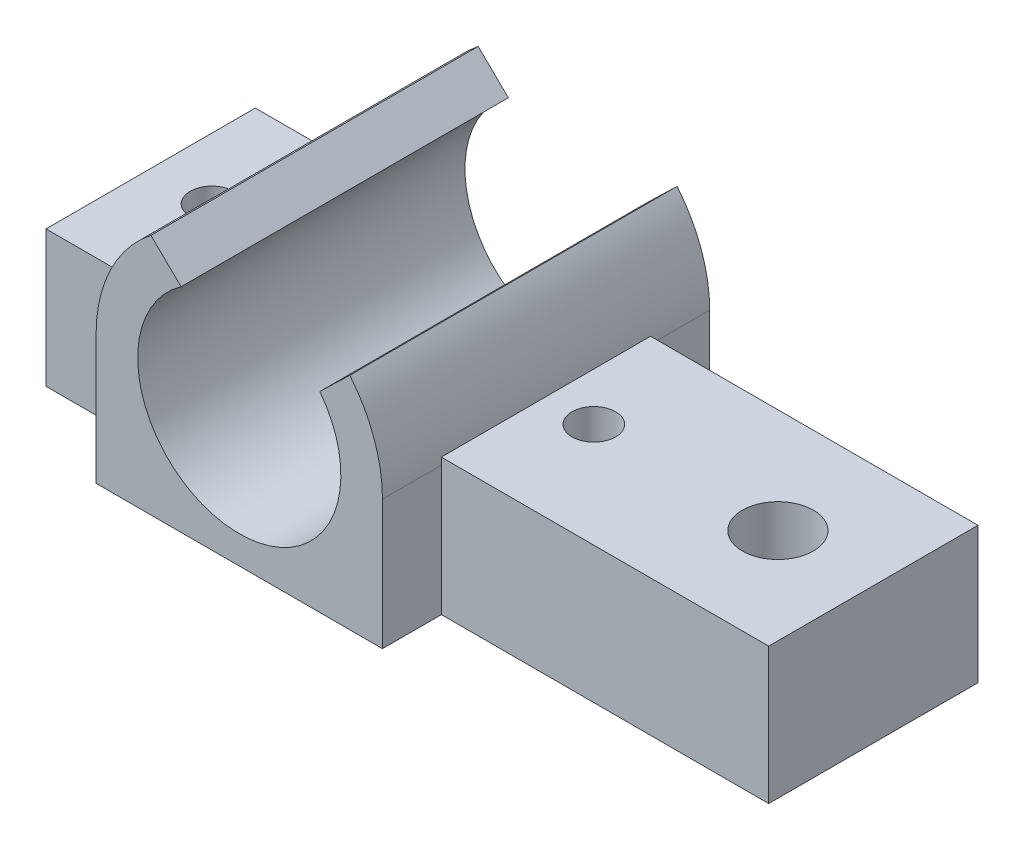
ISO-10303-21;
HEADER;
FILE_DESCRIPTION(('STEP AP214'),'2;1');
FILE_NAME('part.step','',(''),(''),'','','');
FILE_SCHEMA(('AUTOMOTIVE_DESIGN { 1 0 10303 214 1 1 1 1 }'));
ENDSEC;
DATA;
#1=APPLICATION_CONTEXT('core data for automotive mechanical design processes');
#2=APPLICATION_PROTOCOL_DEFINITION('international standard','automotive_design',2000,#1);
#3=PRODUCT_CONTEXT('',#1,'mechanical');
#4=PRODUCT('Part','Part','',(#3));
#5=PRODUCT_RELATED_PRODUCT_CATEGORY('part','',(#4));
#6=PRODUCT_DEFINITION_FORMATION('','',#4);
#7=PRODUCT_DEFINITION_CONTEXT('part definition',#1,'design');
#8=PRODUCT_DEFINITION('design','',#6,#7);
#9=PRODUCT_DEFINITION_SHAPE('','',#8);
#10=(LENGTH_UNIT() NAMED_UNIT(*) SI_UNIT(.MILLI.,.METRE.));
#11=(NAMED_UNIT(*) PLANE_ANGLE_UNIT() SI_UNIT($,.RADIAN.));
#12=(NAMED_UNIT(*) SI_UNIT($,.STERADIAN.) SOLID_ANGLE_UNIT());
#13=UNCERTAINTY_MEASURE_WITH_UNIT(LENGTH_MEASURE(1.E-05),#10,'distance_accuracy_value','');
#14=(GEOMETRIC_REPRESENTATION_CONTEXT(3) GLOBAL_UNCERTAINTY_ASSIGNED_CONTEXT((#13)) GLOBAL_UNIT_ASSIGNED_CONTEXT((#10,
#11,#12)) REPRESENTATION_CONTEXT('',''));
#15=CARTESIAN_POINT('',(0.,0.,0.));
#16=DIRECTION('',(0.,0.,1.));
#17=DIRECTION('',(1.,0.,0.));
#18=AXIS2_PLACEMENT_3D('',#15,#16,#17);
#19=CARTESIAN_POINT('',(66.3937346144684,10.,0.));
#20=DIRECTION('',(0.,-1.,0.));
#21=DIRECTION('',(0.,0.,-1.));
#22=AXIS2_PLACEMENT_3D('',#19,#20,#21);
#23=CYLINDRICAL_SURFACE('',#22,2.6);
#24=CARTESIAN_POINT('',(66.3937346144684,10.,0.));
#25=DIRECTION('',(0.,1.,0.));
#26=DIRECTION('',(0.,0.,1.));
#27=AXIS2_PLACEMENT_3D('',#24,#25,#26);
#28=CIRCLE('',#27,2.6);
#29=CARTESIAN_POINT('',(66.3937346144684,10.,2.6));
#30=VERTEX_POINT('',#29);
#31=EDGE_CURVE('E332',#30,#30,#28,.T.);
#32=ORIENTED_EDGE('',*,*,#31,.T.);
#33=EDGE_LOOP('',(#32));
#34=FACE_BOUND('',#33,.T.);
#35=CARTESIAN_POINT('',(66.3937346144684,4.4,0.));
#36=DIRECTION('',(0.,-1.,0.));
#37=DIRECTION('',(0.,0.,-1.));
#38=AXIS2_PLACEMENT_3D('',#35,#36,#37);
#39=CIRCLE('',#38,2.6);
#40=CARTESIAN_POINT('',(66.3937346144684,4.4,-2.6));
#41=VERTEX_POINT('',#40);
#42=EDGE_CURVE('E223',#41,#41,#39,.T.);
#43=ORIENTED_EDGE('',*,*,#42,.T.);
#44=EDGE_LOOP('',(#43));
#45=FACE_BOUND('',#44,.T.);
#46=ADVANCED_FACE('F35',(#34,#45),#23,.F.);
#47=CARTESIAN_POINT('',(0.,10.,0.));
#48=DIRECTION('',(0.,1.,0.));
#49=DIRECTION('',(0.,0.,1.));
#50=AXIS2_PLACEMENT_3D('',#47,#48,#49);
#51=PLANE('',#50);
#52=DIRECTION('',(0.,0.,-1.));
#53=VECTOR('',#52,1.);
#54=CARTESIAN_POINT('',(49.3818230961699,10.,43.8288287251762));
#55=LINE('',#54,#53);
#56=CARTESIAN_POINT('',(49.3818230961699,10.,7.675));
#57=VERTEX_POINT('',#56);
#58=CARTESIAN_POINT('',(49.3818230961699,10.,-7.675));
#59=VERTEX_POINT('',#58);
#60=EDGE_CURVE('E322',#57,#59,#55,.T.);
#61=ORIENTED_EDGE('',*,*,#60,.F.);
#62=DIRECTION('',(1.,0.,0.));
#63=VECTOR('',#62,1.);
#64=CARTESIAN_POINT('',(73.3937346144684,10.,7.675));
#65=LINE('',#64,#63);
#66=CARTESIAN_POINT('',(73.3937346144684,10.,7.675));
#67=VERTEX_POINT('',#66);
#68=EDGE_CURVE('E351',#57,#67,#65,.T.);
#69=ORIENTED_EDGE('',*,*,#68,.T.);
#70=DIRECTION('',(0.,0.,-1.));
#71=VECTOR('',#70,1.);
#72=CARTESIAN_POINT('',(73.3937346144684,10.,-7.675));
#73=LINE('',#72,#71);
#74=CARTESIAN_POINT('',(73.3937346144684,10.,-7.675));
#75=VERTEX_POINT('',#74);
#76=EDGE_CURVE('E356',#67,#75,#73,.T.);
#77=ORIENTED_EDGE('',*,*,#76,.T.);
#78=DIRECTION('',(-1.,0.,0.));
#79=VECTOR('',#78,1.);
#80=CARTESIAN_POINT('',(73.3937346144684,10.,-7.675));
#81=LINE('',#80,#79);
#82=EDGE_CURVE('E359',#75,#59,#81,.T.);
#83=ORIENTED_EDGE('',*,*,#82,.T.);
#84=EDGE_LOOP('',(#61,#69,#77,#83));
#85=FACE_BOUND('',#84,.T.);
#86=CARTESIAN_POINT('',(52.8937346144684,10.,0.));
#87=DIRECTION('',(0.,1.,0.));
#88=DIRECTION('',(0.,0.,1.));
#89=AXIS2_PLACEMENT_3D('',#86,#87,#88);
#90=CIRCLE('',#89,1.6);
#91=CARTESIAN_POINT('',(52.8937346144684,10.,1.6));
#92=VERTEX_POINT('',#91);
#93=EDGE_CURVE('E342',#92,#92,#90,.T.);
#94=ORIENTED_EDGE('',*,*,#93,.F.);
#95=EDGE_LOOP('',(#94));
#96=FACE_BOUND('',#95,.T.);
#97=ORIENTED_EDGE('',*,*,#31,.F.);
#98=EDGE_LOOP('',(#97));
#99=FACE_BOUND('',#98,.T.);
#100=ADVANCED_FACE('F397',(#85,#96,#99),#51,.T.);
#101=CARTESIAN_POINT('',(73.3937346144684,10.,7.675));
#102=DIRECTION('',(0.,0.,-1.));
#103=DIRECTION('',(-1.,0.,0.));
#104=AXIS2_PLACEMENT_3D('',#101,#102,#103);
#105=PLANE('',#104);
#106=DIRECTION('',(0.,-1.,0.));
#107=VECTOR('',#106,1.);
#108=CARTESIAN_POINT('',(28.3937346144684,10.,7.675));
#109=LINE('',#108,#107);
#110=CARTESIAN_POINT('',(28.3937346144684,9.5,7.67500000000001));
#111=VERTEX_POINT('',#110);
#112=CARTESIAN_POINT('',(28.3937346144684,0.,7.675));
#113=VERTEX_POINT('',#112);
#114=EDGE_CURVE('E330',#111,#113,#109,.T.);
#115=ORIENTED_EDGE('',*,*,#114,.F.);
#116=CARTESIAN_POINT('',(38.8937346144684,9.5,7.67500000000001));
#117=DIRECTION('',(0.,0.,-1.));
#118=DIRECTION('',(-1.,0.,0.));
#119=AXIS2_PLACEMENT_3D('',#116,#117,#118);
#120=CIRCLE('',#119,10.5);
#121=CARTESIAN_POINT('',(28.4056461327669,10.,7.675));
#122=VERTEX_POINT('',#121);
#123=EDGE_CURVE('E319',#111,#122,#120,.T.);
#124=ORIENTED_EDGE('',*,*,#123,.T.);
#125=CARTESIAN_POINT('',(20.3937346144684,10.,7.67500000000001));
#126=VERTEX_POINT('',#125);
#127=EDGE_CURVE('E353',#126,#122,#65,.T.);
#128=ORIENTED_EDGE('',*,*,#127,.F.);
#129=DIRECTION('',(0.,-1.,0.));
#130=VECTOR('',#129,1.);
#131=CARTESIAN_POINT('',(20.3937346144684,10.,7.67500000000001));
#132=LINE('',#131,#130);
#133=CARTESIAN_POINT('',(20.3937346144684,0.,7.67500000000001));
#134=VERTEX_POINT('',#133);
#135=EDGE_CURVE('E382',#126,#134,#132,.T.);
#136=ORIENTED_EDGE('',*,*,#135,.T.);
#137=DIRECTION('',(1.,0.,0.));
#138=VECTOR('',#137,1.);
#139=CARTESIAN_POINT('',(73.3937346144684,0.,7.675));
#140=LINE('',#139,#138);
#141=EDGE_CURVE('E366',#134,#113,#140,.T.);
#142=ORIENTED_EDGE('',*,*,#141,.T.);
#143=EDGE_LOOP('',(#115,#124,#128,#136,#142));
#144=FACE_BOUND('',#143,.T.);
#145=ADVANCED_FACE('F450',(#144),#105,.F.);
#146=CARTESIAN_POINT('',(73.3937346144684,10.,-7.675));
#147=DIRECTION('',(0.,0.,1.));
#148=DIRECTION('',(1.,0.,0.));
#149=AXIS2_PLACEMENT_3D('',#146,#147,#148);
#150=PLANE('',#149);
#151=DIRECTION('',(0.,1.,0.));
#152=VECTOR('',#151,1.);
#153=CARTESIAN_POINT('',(28.3937346144684,10.,-7.675));
#154=LINE('',#153,#152);
#155=CARTESIAN_POINT('',(28.3937346144684,0.,-7.67499999999999));
#156=VERTEX_POINT('',#155);
#157=CARTESIAN_POINT('',(28.3937346144684,9.5,-7.67499999999999));
#158=VERTEX_POINT('',#157);
#159=EDGE_CURVE('E388',#156,#158,#154,.T.);
#160=ORIENTED_EDGE('',*,*,#159,.F.);
#161=DIRECTION('',(-1.,0.,0.));
#162=VECTOR('',#161,1.);
#163=CARTESIAN_POINT('',(73.3937346144684,0.,-7.675));
#164=LINE('',#163,#162);
#165=CARTESIAN_POINT('',(20.3937346144684,0.,-7.67499999999999));
#166=VERTEX_POINT('',#165);
#167=EDGE_CURVE('E371',#156,#166,#164,.T.);
#168=ORIENTED_EDGE('',*,*,#167,.T.);
#169=DIRECTION('',(0.,-1.,0.));
#170=VECTOR('',#169,1.);
#171=CARTESIAN_POINT('',(20.3937346144684,10.,-7.67499999999999));
#172=LINE('',#171,#170);
#173=CARTESIAN_POINT('',(20.3937346144684,10.,-7.67499999999999));
#174=VERTEX_POINT('',#173);
#175=EDGE_CURVE('E362',#174,#166,#172,.T.);
#176=ORIENTED_EDGE('',*,*,#175,.F.);
#177=CARTESIAN_POINT('',(28.4056461327668,10.,-7.67499999999999));
#178=VERTEX_POINT('',#177);
#179=EDGE_CURVE('E358',#178,#174,#81,.T.);
#180=ORIENTED_EDGE('',*,*,#179,.F.);
#181=CARTESIAN_POINT('',(38.8937346144684,9.5,-7.67499999999999));
#182=DIRECTION('',(0.,0.,1.));
#183=DIRECTION('',(1.,0.,0.));
#184=AXIS2_PLACEMENT_3D('',#181,#182,#183);
#185=CIRCLE('',#184,10.5);
#186=EDGE_CURVE('E385',#178,#158,#185,.T.);
#187=ORIENTED_EDGE('',*,*,#186,.T.);
#188=EDGE_LOOP('',(#160,#168,#176,#180,#187));
#189=FACE_BOUND('',#188,.T.);
#190=ADVANCED_FACE('F458',(#189),#150,.F.);
#191=DIRECTION('',(0.,0.,-1.));
#192=VECTOR('',#191,1.);
#193=CARTESIAN_POINT('',(28.4056461327669,10.,43.8288287251762));
#194=LINE('',#193,#192);
#195=EDGE_CURVE('E317',#178,#122,#194,.F.);
#196=ORIENTED_EDGE('',*,*,#195,.F.);
#197=ORIENTED_EDGE('',*,*,#179,.T.);
#198=DIRECTION('',(0.,0.,1.));
#199=VECTOR('',#198,1.);
#200=CARTESIAN_POINT('',(20.3937346144684,10.,7.67500000000001));
#201=LINE('',#200,#199);
#202=EDGE_CURVE('E348',#174,#126,#201,.T.);
#203=ORIENTED_EDGE('',*,*,#202,.T.);
#204=ORIENTED_EDGE('',*,*,#127,.T.);
#205=EDGE_LOOP('',(#196,#197,#203,#204));
#206=FACE_BOUND('',#205,.T.);
#207=CARTESIAN_POINT('',(24.8937346144684,10.,0.));
#208=DIRECTION('',(0.,1.,0.));
#209=DIRECTION('',(0.,0.,1.));
#210=AXIS2_PLACEMENT_3D('',#207,#208,#209);
#211=CIRCLE('',#210,1.6);
#212=CARTESIAN_POINT('',(24.8937346144684,10.,1.6));
#213=VERTEX_POINT('',#212);
#214=EDGE_CURVE('E336',#213,#213,#211,.T.);
#215=ORIENTED_EDGE('',*,*,#214,.F.);
#216=EDGE_LOOP('',(#215));
#217=FACE_BOUND('',#216,.T.);
#218=ADVANCED_FACE('F479',(#206,#217),#51,.T.);
#219=CARTESIAN_POINT('',(0.,0.,0.));
#220=DIRECTION('',(0.,1.,0.));
#221=DIRECTION('',(0.,0.,1.));
#222=AXIS2_PLACEMENT_3D('',#219,#220,#221);
#223=PLANE('',#222);
#224=DIRECTION('',(0.,0.,-1.));
#225=VECTOR('',#224,1.);
#226=CARTESIAN_POINT('',(62.3667164868707,0.,2.325));
#227=LINE('',#226,#225);
#228=CARTESIAN_POINT('',(62.3667164868707,0.,2.325));
#229=VERTEX_POINT('',#228);
#230=CARTESIAN_POINT('',(62.3667164868707,0.,-2.32500000000001));
#231=VERTEX_POINT('',#230);
#232=EDGE_CURVE('E233',#229,#231,#227,.T.);
#233=ORIENTED_EDGE('',*,*,#232,.F.);
#234=DIRECTION('',(-0.866025403784438,0.,-0.5));
#235=VECTOR('',#234,1.);
#236=CARTESIAN_POINT('',(66.3937346144684,0.,4.65));
#237=LINE('',#236,#235);
#238=CARTESIAN_POINT('',(66.3937346144684,0.,4.65));
#239=VERTEX_POINT('',#238);
#240=EDGE_CURVE('E50',#239,#229,#237,.T.);
#241=ORIENTED_EDGE('',*,*,#240,.F.);
#242=DIRECTION('',(-0.866025403784439,0.,0.5));
#243=VECTOR('',#242,1.);
#244=CARTESIAN_POINT('',(70.420752742066,0.,2.32500000000001));
#245=LINE('',#244,#243);
#246=CARTESIAN_POINT('',(70.420752742066,0.,2.32500000000001));
#247=VERTEX_POINT('',#246);
#248=EDGE_CURVE('E217',#247,#239,#245,.T.);
#249=ORIENTED_EDGE('',*,*,#248,.F.);
#250=DIRECTION('',(0.,0.,1.));
#251=VECTOR('',#250,1.);
#252=CARTESIAN_POINT('',(70.420752742066,0.,-2.325));
#253=LINE('',#252,#251);
#254=CARTESIAN_POINT('',(70.420752742066,0.,-2.325));
#255=VERTEX_POINT('',#254);
#256=EDGE_CURVE('E220',#255,#247,#253,.T.);
#257=ORIENTED_EDGE('',*,*,#256,.F.);
#258=DIRECTION('',(0.866025403784438,0.,0.500000000000001));
#259=VECTOR('',#258,1.);
#260=CARTESIAN_POINT('',(66.3937346144684,0.,-4.65));
#261=LINE('',#260,#259);
#262=CARTESIAN_POINT('',(66.3937346144684,0.,-4.65));
#263=VERTEX_POINT('',#262);
#264=EDGE_CURVE('E238',#263,#255,#261,.T.);
#265=ORIENTED_EDGE('',*,*,#264,.F.);
#266=DIRECTION('',(0.866025403784439,0.,-0.499999999999999));
#267=VECTOR('',#266,1.);
#268=CARTESIAN_POINT('',(62.3667164868707,0.,-2.32500000000001));
#269=LINE('',#268,#267);
#270=EDGE_CURVE('E235',#231,#263,#269,.T.);
#271=ORIENTED_EDGE('',*,*,#270,.F.);
#272=EDGE_LOOP('',(#233,#241,#249,#257,#265,#271));
#273=FACE_BOUND('',#272,.T.);
#274=CARTESIAN_POINT('',(49.3937346144684,0.,7.675));
#275=VERTEX_POINT('',#274);
#276=CARTESIAN_POINT('',(73.3937346144684,0.,7.675));
#277=VERTEX_POINT('',#276);
#278=EDGE_CURVE('E365',#275,#277,#140,.T.);
#279=ORIENTED_EDGE('',*,*,#278,.F.);
#280=DIRECTION('',(0.,0.,-1.));
#281=VECTOR('',#280,1.);
#282=CARTESIAN_POINT('',(49.3937346144684,0.,43.8288287251762));
#283=LINE('',#282,#281);
#284=CARTESIAN_POINT('',(49.3937346144684,0.,12.));
#285=VERTEX_POINT('',#284);
#286=EDGE_CURVE('E311',#285,#275,#283,.T.);
#287=ORIENTED_EDGE('',*,*,#286,.F.);
#288=DIRECTION('',(1.,0.,0.));
#289=VECTOR('',#288,1.);
#290=CARTESIAN_POINT('',(49.3937346144684,0.,12.));
#291=LINE('',#290,#289);
#292=CARTESIAN_POINT('',(28.3937346144684,0.,12.));
#293=VERTEX_POINT('',#292);
#294=EDGE_CURVE('E288',#293,#285,#291,.T.);
#295=ORIENTED_EDGE('',*,*,#294,.F.);
#296=DIRECTION('',(0.,0.,-1.));
#297=VECTOR('',#296,1.);
#298=CARTESIAN_POINT('',(28.3937346144684,0.,43.8288287251762));
#299=LINE('',#298,#297);
#300=EDGE_CURVE('E279',#293,#113,#299,.T.);
#301=ORIENTED_EDGE('',*,*,#300,.T.);
#302=ORIENTED_EDGE('',*,*,#141,.F.);
#303=DIRECTION('',(0.,0.,1.));
#304=VECTOR('',#303,1.);
#305=CARTESIAN_POINT('',(20.3937346144684,0.,7.67500000000001));
#306=LINE('',#305,#304);
#307=EDGE_CURVE('E345',#166,#134,#306,.T.);
#308=ORIENTED_EDGE('',*,*,#307,.F.);
#309=ORIENTED_EDGE('',*,*,#167,.F.);
#310=CARTESIAN_POINT('',(28.3937346144684,0.,-12.));
#311=VERTEX_POINT('',#310);
#312=EDGE_CURVE('E313',#156,#311,#299,.T.);
#313=ORIENTED_EDGE('',*,*,#312,.T.);
#314=DIRECTION('',(-1.,0.,0.));
#315=VECTOR('',#314,1.);
#316=CARTESIAN_POINT('',(49.3937346144684,0.,-12.));
#317=LINE('',#316,#315);
#318=CARTESIAN_POINT('',(49.3937346144684,0.,-12.));
#319=VERTEX_POINT('',#318);
#320=EDGE_CURVE('E255',#319,#311,#317,.T.);
#321=ORIENTED_EDGE('',*,*,#320,.F.);
#322=CARTESIAN_POINT('',(49.3937346144684,0.,-7.675));
#323=VERTEX_POINT('',#322);
#324=EDGE_CURVE('E310',#323,#319,#283,.T.);
#325=ORIENTED_EDGE('',*,*,#324,.F.);
#326=CARTESIAN_POINT('',(73.3937346144684,0.,-7.675));
#327=VERTEX_POINT('',#326);
#328=EDGE_CURVE('E352',#327,#323,#164,.T.);
#329=ORIENTED_EDGE('',*,*,#328,.F.);
#330=DIRECTION('',(0.,0.,-1.));
#331=VECTOR('',#330,1.);
#332=CARTESIAN_POINT('',(73.3937346144684,0.,-7.675));
#333=LINE('',#332,#331);
#334=EDGE_CURVE('E369',#277,#327,#333,.T.);
#335=ORIENTED_EDGE('',*,*,#334,.F.);
#336=EDGE_LOOP('',(#279,#287,#295,#301,#302,#308,#309,#313,#321,#325,#329,#335));
#337=FACE_BOUND('',#336,.T.);
#338=CARTESIAN_POINT('',(52.8937346144684,0.,0.));
#339=DIRECTION('',(0.,1.,0.));
#340=DIRECTION('',(0.,0.,1.));
#341=AXIS2_PLACEMENT_3D('',#338,#339,#340);
#342=CIRCLE('',#341,1.6);
#343=CARTESIAN_POINT('',(52.8937346144684,0.,1.6));
#344=VERTEX_POINT('',#343);
#345=EDGE_CURVE('E339',#344,#344,#342,.T.);
#346=ORIENTED_EDGE('',*,*,#345,.T.);
#347=EDGE_LOOP('',(#346));
#348=FACE_BOUND('',#347,.T.);
#349=CARTESIAN_POINT('',(24.8937346144684,0.,0.));
#350=DIRECTION('',(0.,1.,0.));
#351=DIRECTION('',(0.,0.,1.));
#352=AXIS2_PLACEMENT_3D('',#349,#350,#351);
#353=CIRCLE('',#352,1.6);
#354=CARTESIAN_POINT('',(24.8937346144684,0.,1.6));
#355=VERTEX_POINT('',#354);
#356=EDGE_CURVE('E335',#355,#355,#353,.T.);
#357=ORIENTED_EDGE('',*,*,#356,.T.);
#358=EDGE_LOOP('',(#357));
#359=FACE_BOUND('',#358,.T.);
#360=ADVANCED_FACE('F410',(#273,#337,#348,#359),#223,.F.);
#361=CARTESIAN_POINT('',(20.3937346144684,10.,7.67500000000001));
#362=DIRECTION('',(1.,0.,0.));
#363=DIRECTION('',(0.,0.,-1.));
#364=AXIS2_PLACEMENT_3D('',#361,#362,#363);
#365=PLANE('',#364);
#366=ORIENTED_EDGE('',*,*,#307,.T.);
#367=ORIENTED_EDGE('',*,*,#135,.F.);
#368=ORIENTED_EDGE('',*,*,#202,.F.);
#369=ORIENTED_EDGE('',*,*,#175,.T.);
#370=EDGE_LOOP('',(#366,#367,#368,#369));
#371=FACE_BOUND('',#370,.T.);
#372=ADVANCED_FACE('F37',(#371),#365,.F.);
#373=CARTESIAN_POINT('',(38.8937346144684,9.5,7.67500000000001));
#374=DIRECTION('',(0.,0.,-1.));
#375=DIRECTION('',(-1.,0.,0.));
#376=AXIS2_PLACEMENT_3D('',#373,#374,#375);
#377=CIRCLE('',#376,10.5);
#378=CARTESIAN_POINT('',(49.3937346144684,9.5,7.67500000000001));
#379=VERTEX_POINT('',#378);
#380=EDGE_CURVE('E324',#57,#379,#377,.T.);
#381=ORIENTED_EDGE('',*,*,#380,.T.);
#382=DIRECTION('',(0.,-1.,0.));
#383=VECTOR('',#382,1.);
#384=CARTESIAN_POINT('',(49.3937346144684,10.,7.675));
#385=LINE('',#384,#383);
#386=EDGE_CURVE('E327',#379,#275,#385,.T.);
#387=ORIENTED_EDGE('',*,*,#386,.T.);
#388=ORIENTED_EDGE('',*,*,#278,.T.);
#389=DIRECTION('',(0.,-1.,0.));
#390=VECTOR('',#389,1.);
#391=CARTESIAN_POINT('',(73.3937346144684,10.,7.675));
#392=LINE('',#391,#390);
#393=EDGE_CURVE('E379',#67,#277,#392,.T.);
#394=ORIENTED_EDGE('',*,*,#393,.F.);
#395=ORIENTED_EDGE('',*,*,#68,.F.);
#396=EDGE_LOOP('',(#381,#387,#388,#394,#395));
#397=FACE_BOUND('',#396,.T.);
#398=ADVANCED_FACE('F497',(#397),#105,.F.);
#399=CARTESIAN_POINT('',(73.3937346144684,10.,-7.675));
#400=DIRECTION('',(-1.,0.,0.));
#401=DIRECTION('',(0.,0.,1.));
#402=AXIS2_PLACEMENT_3D('',#399,#400,#401);
#403=PLANE('',#402);
#404=ORIENTED_EDGE('',*,*,#334,.T.);
#405=DIRECTION('',(0.,-1.,0.));
#406=VECTOR('',#405,1.);
#407=CARTESIAN_POINT('',(73.3937346144684,10.,-7.675));
#408=LINE('',#407,#406);
#409=EDGE_CURVE('E376',#75,#327,#408,.T.);
#410=ORIENTED_EDGE('',*,*,#409,.F.);
#411=ORIENTED_EDGE('',*,*,#76,.F.);
#412=ORIENTED_EDGE('',*,*,#393,.T.);
#413=EDGE_LOOP('',(#404,#410,#411,#412));
#414=FACE_BOUND('',#413,.T.);
#415=ADVANCED_FACE('F404',(#414),#403,.F.);
#416=ORIENTED_EDGE('',*,*,#328,.T.);
#417=DIRECTION('',(0.,1.,0.));
#418=VECTOR('',#417,1.);
#419=CARTESIAN_POINT('',(49.3937346144684,10.,-7.675));
#420=LINE('',#419,#418);
#421=CARTESIAN_POINT('',(49.3937346144684,9.5,-7.67499999999999));
#422=VERTEX_POINT('',#421);
#423=EDGE_CURVE('E12',#323,#422,#420,.T.);
#424=ORIENTED_EDGE('',*,*,#423,.T.);
#425=CARTESIAN_POINT('',(38.8937346144684,9.5,-7.67499999999999));
#426=DIRECTION('',(0.,0.,1.));
#427=DIRECTION('',(1.,0.,0.));
#428=AXIS2_PLACEMENT_3D('',#425,#426,#427);
#429=CIRCLE('',#428,10.5);
#430=EDGE_CURVE('E43',#422,#59,#429,.T.);
#431=ORIENTED_EDGE('',*,*,#430,.T.);
#432=ORIENTED_EDGE('',*,*,#82,.F.);
#433=ORIENTED_EDGE('',*,*,#409,.T.);
#434=EDGE_LOOP('',(#416,#424,#431,#432,#433));
#435=FACE_BOUND('',#434,.T.);
#436=ADVANCED_FACE('F392',(#435),#150,.F.);
#437=CARTESIAN_POINT('',(52.8937346144684,10.,0.));
#438=DIRECTION('',(0.,-1.,0.));
#439=DIRECTION('',(0.,0.,-1.));
#440=AXIS2_PLACEMENT_3D('',#437,#438,#439);
#441=CYLINDRICAL_SURFACE('',#440,1.6);
#442=ORIENTED_EDGE('',*,*,#93,.T.);
#443=EDGE_LOOP('',(#442));
#444=FACE_BOUND('',#443,.T.);
#445=ORIENTED_EDGE('',*,*,#345,.F.);
#446=EDGE_LOOP('',(#445));
#447=FACE_BOUND('',#446,.T.);
#448=ADVANCED_FACE('F484',(#444,#447),#441,.F.);
#449=CARTESIAN_POINT('',(24.8937346144684,10.,0.));
#450=DIRECTION('',(0.,-1.,0.));
#451=DIRECTION('',(0.,0.,-1.));
#452=AXIS2_PLACEMENT_3D('',#449,#450,#451);
#453=CYLINDRICAL_SURFACE('',#452,1.6);
#454=ORIENTED_EDGE('',*,*,#214,.T.);
#455=EDGE_LOOP('',(#454));
#456=FACE_BOUND('',#455,.T.);
#457=ORIENTED_EDGE('',*,*,#356,.F.);
#458=EDGE_LOOP('',(#457));
#459=FACE_BOUND('',#458,.T.);
#460=ADVANCED_FACE('F471',(#456,#459),#453,.F.);
#461=CARTESIAN_POINT('',(28.3937346144684,9.5,43.8288287251762));
#462=DIRECTION('',(1.,0.,0.));
#463=DIRECTION('',(0.,0.,-1.));
#464=AXIS2_PLACEMENT_3D('',#461,#462,#463);
#465=PLANE('',#464);
#466=DIRECTION('',(0.,0.,-1.));
#467=VECTOR('',#466,1.);
#468=CARTESIAN_POINT('',(28.3937346144684,9.5,43.8288287251762));
#469=LINE('',#468,#467);
#470=CARTESIAN_POINT('',(28.3937346144684,9.5,12.));
#471=VERTEX_POINT('',#470);
#472=EDGE_CURVE('E294',#471,#111,#469,.T.);
#473=ORIENTED_EDGE('',*,*,#472,.T.);
#474=ORIENTED_EDGE('',*,*,#114,.T.);
#475=ORIENTED_EDGE('',*,*,#300,.F.);
#476=DIRECTION('',(0.,1.,0.));
#477=VECTOR('',#476,1.);
#478=CARTESIAN_POINT('',(28.3937346144684,9.5,12.));
#479=LINE('',#478,#477);
#480=EDGE_CURVE('E290',#293,#471,#479,.T.);
#481=ORIENTED_EDGE('',*,*,#480,.T.);
#482=EDGE_LOOP('',(#473,#474,#475,#481));
#483=FACE_BOUND('',#482,.T.);
#484=ADVANCED_FACE('F445',(#483),#465,.F.);
#485=ORIENTED_EDGE('',*,*,#312,.F.);
#486=ORIENTED_EDGE('',*,*,#159,.T.);
#487=CARTESIAN_POINT('',(28.3937346144684,9.5,-12.));
#488=VERTEX_POINT('',#487);
#489=EDGE_CURVE('E58',#158,#488,#469,.T.);
#490=ORIENTED_EDGE('',*,*,#489,.T.);
#491=DIRECTION('',(0.,-1.,0.));
#492=VECTOR('',#491,1.);
#493=CARTESIAN_POINT('',(28.3937346144684,9.5,-12.));
#494=LINE('',#493,#492);
#495=EDGE_CURVE('E245',#488,#311,#494,.T.);
#496=ORIENTED_EDGE('',*,*,#495,.T.);
#497=EDGE_LOOP('',(#485,#486,#490,#496));
#498=FACE_BOUND('',#497,.T.);
#499=ADVANCED_FACE('F461',(#498),#465,.F.);
#500=CARTESIAN_POINT('',(49.3937346144684,9.5,43.8288287251762));
#501=DIRECTION('',(1.,0.,0.));
#502=DIRECTION('',(0.,0.,-1.));
#503=AXIS2_PLACEMENT_3D('',#500,#501,#502);
#504=PLANE('',#503);
#505=ORIENTED_EDGE('',*,*,#386,.F.);
#506=DIRECTION('',(0.,0.,-1.));
#507=VECTOR('',#506,1.);
#508=CARTESIAN_POINT('',(49.3937346144684,9.5,43.8288287251762));
#509=LINE('',#508,#507);
#510=CARTESIAN_POINT('',(49.3937346144684,9.5,12.));
#511=VERTEX_POINT('',#510);
#512=EDGE_CURVE('E307',#511,#379,#509,.T.);
#513=ORIENTED_EDGE('',*,*,#512,.F.);
#514=DIRECTION('',(0.,1.,0.));
#515=VECTOR('',#514,1.);
#516=CARTESIAN_POINT('',(49.3937346144684,9.5,12.));
#517=LINE('',#516,#515);
#518=EDGE_CURVE('E286',#285,#511,#517,.T.);
#519=ORIENTED_EDGE('',*,*,#518,.F.);
#520=ORIENTED_EDGE('',*,*,#286,.T.);
#521=EDGE_LOOP('',(#505,#513,#519,#520));
#522=FACE_BOUND('',#521,.T.);
#523=ADVANCED_FACE('F463',(#522),#504,.T.);
#524=ORIENTED_EDGE('',*,*,#423,.F.);
#525=ORIENTED_EDGE('',*,*,#324,.T.);
#526=DIRECTION('',(0.,-1.,0.));
#527=VECTOR('',#526,1.);
#528=CARTESIAN_POINT('',(49.3937346144684,9.5,-12.));
#529=LINE('',#528,#527);
#530=CARTESIAN_POINT('',(49.3937346144684,9.5,-12.));
#531=VERTEX_POINT('',#530);
#532=EDGE_CURVE('E258',#531,#319,#529,.T.);
#533=ORIENTED_EDGE('',*,*,#532,.F.);
#534=EDGE_CURVE('E306',#422,#531,#509,.T.);
#535=ORIENTED_EDGE('',*,*,#534,.F.);
#536=EDGE_LOOP('',(#524,#525,#533,#535));
#537=FACE_BOUND('',#536,.T.);
#538=ADVANCED_FACE('F415',(#537),#504,.T.);
#539=CARTESIAN_POINT('',(38.8937346144684,9.5,43.8288287251762));
#540=DIRECTION('',(0.,0.,-1.));
#541=DIRECTION('',(-1.,0.,0.));
#542=AXIS2_PLACEMENT_3D('',#539,#540,#541);
#543=CYLINDRICAL_SURFACE('',#542,10.5);
#544=ORIENTED_EDGE('',*,*,#380,.F.);
#545=ORIENTED_EDGE('',*,*,#60,.T.);
#546=ORIENTED_EDGE('',*,*,#430,.F.);
#547=ORIENTED_EDGE('',*,*,#534,.T.);
#548=CARTESIAN_POINT('',(38.8937346144684,9.5,-12.));
#549=DIRECTION('',(0.,0.,-1.));
#550=DIRECTION('',(-1.,0.,0.));
#551=AXIS2_PLACEMENT_3D('',#548,#549,#550);
#552=CIRCLE('',#551,10.5);
#553=CARTESIAN_POINT('',(47.0022725648829,16.170952878464,-12.));
#554=VERTEX_POINT('',#553);
#555=EDGE_CURVE('E261',#554,#531,#552,.T.);
#556=ORIENTED_EDGE('',*,*,#555,.F.);
#557=DIRECTION('',(0.,0.,-1.));
#558=VECTOR('',#557,1.);
#559=CARTESIAN_POINT('',(47.002272564883,16.170952878464,43.8288287251762));
#560=LINE('',#559,#558);
#561=CARTESIAN_POINT('',(47.002272564883,16.170952878464,12.));
#562=VERTEX_POINT('',#561);
#563=EDGE_CURVE('E304',#562,#554,#560,.T.);
#564=ORIENTED_EDGE('',*,*,#563,.F.);
#565=CARTESIAN_POINT('',(38.8937346144684,9.5,12.));
#566=DIRECTION('',(0.,0.,-1.));
#567=DIRECTION('',(-1.,0.,0.));
#568=AXIS2_PLACEMENT_3D('',#565,#566,#567);
#569=CIRCLE('',#568,10.5);
#570=EDGE_CURVE('E284',#511,#562,#569,.F.);
#571=ORIENTED_EDGE('',*,*,#570,.F.);
#572=ORIENTED_EDGE('',*,*,#512,.T.);
#573=EDGE_LOOP('',(#544,#545,#546,#547,#556,#564,#571,#572));
#574=FACE_BOUND('',#573,.T.);
#575=ADVANCED_FACE('F423',(#574),#543,.T.);
#576=CARTESIAN_POINT('',(38.8937346144684,9.5,43.8288287251762));
#577=DIRECTION('',(0.,0.,-1.));
#578=DIRECTION('',(-1.,0.,0.));
#579=AXIS2_PLACEMENT_3D('',#576,#577,#578);
#580=CYLINDRICAL_SURFACE('',#579,7.45);
#581=CARTESIAN_POINT('',(38.8937346144684,9.5,-12.));
#582=DIRECTION('',(0.,0.,-1.));
#583=DIRECTION('',(-1.,0.,0.));
#584=AXIS2_PLACEMENT_3D('',#581,#582,#583);
#585=CIRCLE('',#584,7.45);
#586=CARTESIAN_POINT('',(44.8016485618914,14.0386179382984,-12.));
#587=VERTEX_POINT('',#586);
#588=CARTESIAN_POINT('',(34.6284074227169,15.6081489788074,-12.));
#589=VERTEX_POINT('',#588);
#590=EDGE_CURVE('E267',#587,#589,#585,.T.);
#591=ORIENTED_EDGE('',*,*,#590,.T.);
#592=DIRECTION('',(0.,0.,-1.));
#593=VECTOR('',#592,1.);
#594=CARTESIAN_POINT('',(34.6284074227169,15.6081489788074,43.8288287251762));
#595=LINE('',#594,#593);
#596=CARTESIAN_POINT('',(34.6284074227169,15.6081489788074,12.));
#597=VERTEX_POINT('',#596);
#598=EDGE_CURVE('E299',#597,#589,#595,.T.);
#599=ORIENTED_EDGE('',*,*,#598,.F.);
#600=CARTESIAN_POINT('',(38.8937346144684,9.5,12.));
#601=DIRECTION('',(0.,0.,-1.));
#602=DIRECTION('',(-1.,0.,0.));
#603=AXIS2_PLACEMENT_3D('',#600,#601,#602);
#604=CIRCLE('',#603,7.45);
#605=CARTESIAN_POINT('',(44.8016485618914,14.0386179382984,12.));
#606=VERTEX_POINT('',#605);
#607=EDGE_CURVE('E278',#597,#606,#604,.F.);
#608=ORIENTED_EDGE('',*,*,#607,.T.);
#609=DIRECTION('',(0.,0.,-1.));
#610=VECTOR('',#609,1.);
#611=CARTESIAN_POINT('',(44.8016485618914,14.0386179382984,43.8288287251762));
#612=LINE('',#611,#610);
#613=EDGE_CURVE('E302',#606,#587,#612,.T.);
#614=ORIENTED_EDGE('',*,*,#613,.T.);
#615=EDGE_LOOP('',(#591,#599,#608,#614));
#616=FACE_BOUND('',#615,.T.);
#617=ADVANCED_FACE('F434',(#616),#580,.F.);
#618=CARTESIAN_POINT('',(38.8937346144684,9.5,43.8288287251762));
#619=DIRECTION('',(0.,0.,-1.));
#620=DIRECTION('',(-1.,0.,0.));
#621=AXIS2_PLACEMENT_3D('',#618,#619,#620);
#622=CYLINDRICAL_SURFACE('',#621,10.5);
#623=ORIENTED_EDGE('',*,*,#123,.F.);
#624=ORIENTED_EDGE('',*,*,#472,.F.);
#625=CARTESIAN_POINT('',(38.8937346144684,9.5,12.));
#626=DIRECTION('',(0.,0.,-1.));
#627=DIRECTION('',(-1.,0.,0.));
#628=AXIS2_PLACEMENT_3D('',#625,#626,#627);
#629=CIRCLE('',#628,10.5);
#630=CARTESIAN_POINT('',(32.4128085324897,17.7612103907314,12.));
#631=VERTEX_POINT('',#630);
#632=EDGE_CURVE('E293',#631,#471,#629,.F.);
#633=ORIENTED_EDGE('',*,*,#632,.F.);
#634=DIRECTION('',(0.,0.,-1.));
#635=VECTOR('',#634,1.);
#636=CARTESIAN_POINT('',(32.4128085324897,17.7612103907314,43.8288287251762));
#637=LINE('',#636,#635);
#638=CARTESIAN_POINT('',(32.4128085324897,17.7612103907314,-12.));
#639=VERTEX_POINT('',#638);
#640=EDGE_CURVE('E297',#631,#639,#637,.T.);
#641=ORIENTED_EDGE('',*,*,#640,.T.);
#642=CARTESIAN_POINT('',(38.8937346144684,9.5,-12.));
#643=DIRECTION('',(0.,0.,-1.));
#644=DIRECTION('',(-1.,0.,0.));
#645=AXIS2_PLACEMENT_3D('',#642,#643,#644);
#646=CIRCLE('',#645,10.5);
#647=EDGE_CURVE('E272',#488,#639,#646,.T.);
#648=ORIENTED_EDGE('',*,*,#647,.F.);
#649=ORIENTED_EDGE('',*,*,#489,.F.);
#650=ORIENTED_EDGE('',*,*,#186,.F.);
#651=ORIENTED_EDGE('',*,*,#195,.T.);
#652=EDGE_LOOP('',(#623,#624,#633,#641,#648,#649,#650,#651));
#653=FACE_BOUND('',#652,.T.);
#654=ADVANCED_FACE('F439',(#653),#622,.T.);
#655=CARTESIAN_POINT('',(44.8016485618914,14.0386179382984,43.8288287251762));
#656=DIRECTION('',(-0.695876093554061,0.718161863663018,0.));
#657=DIRECTION('',(-0.718161863663018,-0.695876093554061,0.));
#658=AXIS2_PLACEMENT_3D('',#655,#656,#657);
#659=PLANE('',#658);
#660=DIRECTION('',(-0.718161863663018,-0.695876093554061,0.));
#661=VECTOR('',#660,1.);
#662=CARTESIAN_POINT('',(44.8016485618914,14.0386179382984,12.));
#663=LINE('',#662,#661);
#664=EDGE_CURVE('E282',#562,#606,#663,.T.);
#665=ORIENTED_EDGE('',*,*,#664,.F.);
#666=ORIENTED_EDGE('',*,*,#563,.T.);
#667=DIRECTION('',(0.718161863663018,0.695876093554061,0.));
#668=VECTOR('',#667,1.);
#669=CARTESIAN_POINT('',(44.8016485618914,14.0386179382984,-12.));
#670=LINE('',#669,#668);
#671=EDGE_CURVE('E264',#587,#554,#670,.T.);
#672=ORIENTED_EDGE('',*,*,#671,.F.);
#673=ORIENTED_EDGE('',*,*,#613,.F.);
#674=EDGE_LOOP('',(#665,#666,#672,#673));
#675=FACE_BOUND('',#674,.T.);
#676=ADVANCED_FACE('F428',(#675),#659,.T.);
#677=CARTESIAN_POINT('',(34.6284074227169,15.6081489788074,43.8288287251762));
#678=DIRECTION('',(-0.696913128410619,-0.717155555963226,0.));
#679=DIRECTION('',(0.717155555963226,-0.696913128410619,0.));
#680=AXIS2_PLACEMENT_3D('',#677,#678,#679);
#681=PLANE('',#680);
#682=ORIENTED_EDGE('',*,*,#640,.F.);
#683=DIRECTION('',(0.717155555963226,-0.696913128410619,0.));
#684=VECTOR('',#683,1.);
#685=CARTESIAN_POINT('',(34.6284074227169,15.6081489788074,12.));
#686=LINE('',#685,#684);
#687=EDGE_CURVE('E275',#631,#597,#686,.T.);
#688=ORIENTED_EDGE('',*,*,#687,.T.);
#689=ORIENTED_EDGE('',*,*,#598,.T.);
#690=DIRECTION('',(-0.717155555963226,0.696913128410619,0.));
#691=VECTOR('',#690,1.);
#692=CARTESIAN_POINT('',(34.6284074227169,15.6081489788074,-12.));
#693=LINE('',#692,#691);
#694=EDGE_CURVE('E269',#589,#639,#693,.T.);
#695=ORIENTED_EDGE('',*,*,#694,.T.);
#696=EDGE_LOOP('',(#682,#688,#689,#695));
#697=FACE_BOUND('',#696,.T.);
#698=ADVANCED_FACE('F438',(#697),#681,.F.);
#699=CARTESIAN_POINT('',(73.3937346144684,10.,12.));
#700=DIRECTION('',(0.,0.,-1.));
#701=DIRECTION('',(-1.,0.,0.));
#702=AXIS2_PLACEMENT_3D('',#699,#700,#701);
#703=PLANE('',#702);
#704=ORIENTED_EDGE('',*,*,#294,.T.);
#705=ORIENTED_EDGE('',*,*,#518,.T.);
#706=ORIENTED_EDGE('',*,*,#570,.T.);
#707=ORIENTED_EDGE('',*,*,#664,.T.);
#708=ORIENTED_EDGE('',*,*,#607,.F.);
#709=ORIENTED_EDGE('',*,*,#687,.F.);
#710=ORIENTED_EDGE('',*,*,#632,.T.);
#711=ORIENTED_EDGE('',*,*,#480,.F.);
#712=EDGE_LOOP('',(#704,#705,#706,#707,#708,#709,#710,#711));
#713=FACE_BOUND('',#712,.T.);
#714=ADVANCED_FACE('F431',(#713),#703,.F.);
#715=CARTESIAN_POINT('',(38.8937346144684,9.5,-12.));
#716=DIRECTION('',(0.,0.,-1.));
#717=DIRECTION('',(-1.,0.,0.));
#718=AXIS2_PLACEMENT_3D('',#715,#716,#717);
#719=PLANE('',#718);
#720=ORIENTED_EDGE('',*,*,#495,.F.);
#721=ORIENTED_EDGE('',*,*,#647,.T.);
#722=ORIENTED_EDGE('',*,*,#694,.F.);
#723=ORIENTED_EDGE('',*,*,#590,.F.);
#724=ORIENTED_EDGE('',*,*,#671,.T.);
#725=ORIENTED_EDGE('',*,*,#555,.T.);
#726=ORIENTED_EDGE('',*,*,#532,.T.);
#727=ORIENTED_EDGE('',*,*,#320,.T.);
#728=EDGE_LOOP('',(#720,#721,#722,#723,#724,#725,#726,#727));
#729=FACE_BOUND('',#728,.T.);
#730=ADVANCED_FACE('F418',(#729),#719,.T.);
#731=CARTESIAN_POINT('',(66.3937346144684,4.,4.65));
#732=DIRECTION('',(-0.5,0.,0.866025403784438));
#733=DIRECTION('',(0.866025403784438,0.,0.5));
#734=AXIS2_PLACEMENT_3D('',#731,#732,#733);
#735=PLANE('',#734);
#736=ORIENTED_EDGE('',*,*,#240,.T.);
#737=DIRECTION('',(0.,-1.,0.));
#738=VECTOR('',#737,1.);
#739=CARTESIAN_POINT('',(62.3667164868707,4.,2.325));
#740=LINE('',#739,#738);
#741=CARTESIAN_POINT('',(62.3667164868707,4.,2.325));
#742=VERTEX_POINT('',#741);
#743=EDGE_CURVE('E194',#742,#229,#740,.T.);
#744=ORIENTED_EDGE('',*,*,#743,.F.);
#745=DIRECTION('',(-0.866025403784438,0.,-0.5));
#746=VECTOR('',#745,1.);
#747=CARTESIAN_POINT('',(66.3937346144684,4.,4.65));
#748=LINE('',#747,#746);
#749=CARTESIAN_POINT('',(66.3937346144684,4.,4.65));
#750=VERTEX_POINT('',#749);
#751=EDGE_CURVE('E198',#750,#742,#748,.T.);
#752=ORIENTED_EDGE('',*,*,#751,.F.);
#753=DIRECTION('',(0.,-1.,0.));
#754=VECTOR('',#753,1.);
#755=CARTESIAN_POINT('',(66.3937346144684,4.,4.65));
#756=LINE('',#755,#754);
#757=EDGE_CURVE('E243',#750,#239,#756,.T.);
#758=ORIENTED_EDGE('',*,*,#757,.T.);
#759=EDGE_LOOP('',(#736,#744,#752,#758));
#760=FACE_BOUND('',#759,.T.);
#761=ADVANCED_FACE('F196',(#760),#735,.F.);
#762=CARTESIAN_POINT('',(70.420752742066,4.,2.32500000000001));
#763=DIRECTION('',(0.5,0.,0.866025403784439));
#764=DIRECTION('',(0.866025403784439,0.,-0.5));
#765=AXIS2_PLACEMENT_3D('',#762,#763,#764);
#766=PLANE('',#765);
#767=ORIENTED_EDGE('',*,*,#248,.T.);
#768=ORIENTED_EDGE('',*,*,#757,.F.);
#769=DIRECTION('',(-0.866025403784439,0.,0.5));
#770=VECTOR('',#769,1.);
#771=CARTESIAN_POINT('',(70.420752742066,4.,2.32500000000001));
#772=LINE('',#771,#770);
#773=CARTESIAN_POINT('',(70.420752742066,4.,2.32500000000001));
#774=VERTEX_POINT('',#773);
#775=EDGE_CURVE('E204',#774,#750,#772,.T.);
#776=ORIENTED_EDGE('',*,*,#775,.F.);
#777=DIRECTION('',(0.,-1.,0.));
#778=VECTOR('',#777,1.);
#779=CARTESIAN_POINT('',(70.420752742066,4.,2.32500000000001));
#780=LINE('',#779,#778);
#781=EDGE_CURVE('E246',#774,#247,#780,.T.);
#782=ORIENTED_EDGE('',*,*,#781,.T.);
#783=EDGE_LOOP('',(#767,#768,#776,#782));
#784=FACE_BOUND('',#783,.T.);
#785=ADVANCED_FACE('F649',(#784),#766,.F.);
#786=CARTESIAN_POINT('',(70.420752742066,4.,-2.325));
#787=DIRECTION('',(1.,0.,0.));
#788=DIRECTION('',(0.,0.,-1.));
#789=AXIS2_PLACEMENT_3D('',#786,#787,#788);
#790=PLANE('',#789);
#791=ORIENTED_EDGE('',*,*,#256,.T.);
#792=ORIENTED_EDGE('',*,*,#781,.F.);
#793=DIRECTION('',(0.,0.,1.));
#794=VECTOR('',#793,1.);
#795=CARTESIAN_POINT('',(70.420752742066,4.,-2.325));
#796=LINE('',#795,#794);
#797=CARTESIAN_POINT('',(70.420752742066,4.,-2.325));
#798=VERTEX_POINT('',#797);
#799=EDGE_CURVE('E229',#798,#774,#796,.T.);
#800=ORIENTED_EDGE('',*,*,#799,.F.);
#801=DIRECTION('',(0.,-1.,0.));
#802=VECTOR('',#801,1.);
#803=CARTESIAN_POINT('',(70.420752742066,4.,-2.325));
#804=LINE('',#803,#802);
#805=EDGE_CURVE('E248',#798,#255,#804,.T.);
#806=ORIENTED_EDGE('',*,*,#805,.T.);
#807=EDGE_LOOP('',(#791,#792,#800,#806));
#808=FACE_BOUND('',#807,.T.);
#809=ADVANCED_FACE('F655',(#808),#790,.F.);
#810=CARTESIAN_POINT('',(66.3937346144684,4.,-4.65));
#811=DIRECTION('',(0.500000000000001,0.,-0.866025403784438));
#812=DIRECTION('',(-0.866025403784438,0.,-0.500000000000001));
#813=AXIS2_PLACEMENT_3D('',#810,#811,#812);
#814=PLANE('',#813);
#815=ORIENTED_EDGE('',*,*,#264,.T.);
#816=ORIENTED_EDGE('',*,*,#805,.F.);
#817=DIRECTION('',(0.866025403784438,0.,0.500000000000001));
#818=VECTOR('',#817,1.);
#819=CARTESIAN_POINT('',(66.3937346144684,4.,-4.65));
#820=LINE('',#819,#818);
#821=CARTESIAN_POINT('',(66.3937346144684,4.,-4.65));
#822=VERTEX_POINT('',#821);
#823=EDGE_CURVE('E226',#822,#798,#820,.T.);
#824=ORIENTED_EDGE('',*,*,#823,.F.);
#825=DIRECTION('',(0.,-1.,0.));
#826=VECTOR('',#825,1.);
#827=CARTESIAN_POINT('',(66.3937346144684,4.,-4.65));
#828=LINE('',#827,#826);
#829=EDGE_CURVE('E250',#822,#263,#828,.T.);
#830=ORIENTED_EDGE('',*,*,#829,.T.);
#831=EDGE_LOOP('',(#815,#816,#824,#830));
#832=FACE_BOUND('',#831,.T.);
#833=ADVANCED_FACE('F663',(#832),#814,.F.);
#834=CARTESIAN_POINT('',(62.3667164868707,4.,-2.32500000000001));
#835=DIRECTION('',(-0.5,0.,-0.866025403784439));
#836=DIRECTION('',(-0.866025403784439,0.,0.499999999999999));
#837=AXIS2_PLACEMENT_3D('',#834,#835,#836);
#838=PLANE('',#837);
#839=ORIENTED_EDGE('',*,*,#270,.T.);
#840=ORIENTED_EDGE('',*,*,#829,.F.);
#841=DIRECTION('',(0.866025403784439,0.,-0.499999999999999));
#842=VECTOR('',#841,1.);
#843=CARTESIAN_POINT('',(62.3667164868707,4.,-2.32500000000001));
#844=LINE('',#843,#842);
#845=CARTESIAN_POINT('',(62.3667164868707,4.,-2.32500000000001));
#846=VERTEX_POINT('',#845);
#847=EDGE_CURVE('E212',#846,#822,#844,.T.);
#848=ORIENTED_EDGE('',*,*,#847,.F.);
#849=DIRECTION('',(0.,-1.,0.));
#850=VECTOR('',#849,1.);
#851=CARTESIAN_POINT('',(62.3667164868707,4.,-2.32500000000001));
#852=LINE('',#851,#850);
#853=EDGE_CURVE('E203',#846,#231,#852,.T.);
#854=ORIENTED_EDGE('',*,*,#853,.T.);
#855=EDGE_LOOP('',(#839,#840,#848,#854));
#856=FACE_BOUND('',#855,.T.);
#857=ADVANCED_FACE('F671',(#856),#838,.F.);
#858=CARTESIAN_POINT('',(62.3667164868707,4.,2.325));
#859=DIRECTION('',(-1.,0.,0.));
#860=DIRECTION('',(0.,0.,1.));
#861=AXIS2_PLACEMENT_3D('',#858,#859,#860);
#862=PLANE('',#861);
#863=ORIENTED_EDGE('',*,*,#232,.T.);
#864=ORIENTED_EDGE('',*,*,#853,.F.);
#865=DIRECTION('',(0.,0.,-1.));
#866=VECTOR('',#865,1.);
#867=CARTESIAN_POINT('',(62.3667164868707,4.,2.325));
#868=LINE('',#867,#866);
#869=EDGE_CURVE('E207',#742,#846,#868,.T.);
#870=ORIENTED_EDGE('',*,*,#869,.F.);
#871=ORIENTED_EDGE('',*,*,#743,.T.);
#872=EDGE_LOOP('',(#863,#864,#870,#871));
#873=FACE_BOUND('',#872,.T.);
#874=ADVANCED_FACE('F208',(#873),#862,.F.);
#875=CARTESIAN_POINT('',(0.,4.,0.));
#876=DIRECTION('',(0.,-1.,0.));
#877=DIRECTION('',(0.,0.,-1.));
#878=AXIS2_PLACEMENT_3D('',#875,#876,#877);
#879=PLANE('',#878);
#880=ORIENTED_EDGE('',*,*,#751,.T.);
#881=ORIENTED_EDGE('',*,*,#869,.T.);
#882=ORIENTED_EDGE('',*,*,#847,.T.);
#883=ORIENTED_EDGE('',*,*,#823,.T.);
#884=ORIENTED_EDGE('',*,*,#799,.T.);
#885=ORIENTED_EDGE('',*,*,#775,.T.);
#886=EDGE_LOOP('',(#880,#881,#882,#883,#884,#885));
#887=FACE_BOUND('',#886,.T.);
#888=ADVANCED_FACE('F214',(#887),#879,.T.);
#889=CARTESIAN_POINT('',(66.3937346144684,4.4,0.));
#890=DIRECTION('',(0.,-1.,0.));
#891=DIRECTION('',(0.,0.,-1.));
#892=AXIS2_PLACEMENT_3D('',#889,#890,#891);
#893=PLANE('',#892);
#894=ORIENTED_EDGE('',*,*,#42,.F.);
#895=EDGE_LOOP('',(#894));
#896=FACE_BOUND('',#895,.T.);
#897=ADVANCED_FACE('F692',(#896),#893,.F.);
#898=CLOSED_SHELL('',(#46,#100,#145,#190,#218,#360,#372,#398,#415,#436,#448,#460,#484,#499,#523,
#538,#575,#617,#654,#676,#698,#714,#730,#761,#785,#809,#833,#857,#874,#888,#897));
#899=MANIFOLD_SOLID_BREP('B2',#898);
#900=ADVANCED_BREP_SHAPE_REPRESENTATION('',(#18,#899),#14);
#901=SHAPE_DEFINITION_REPRESENTATION(#9,#900);
ENDSEC;
END-ISO-10303-21;
